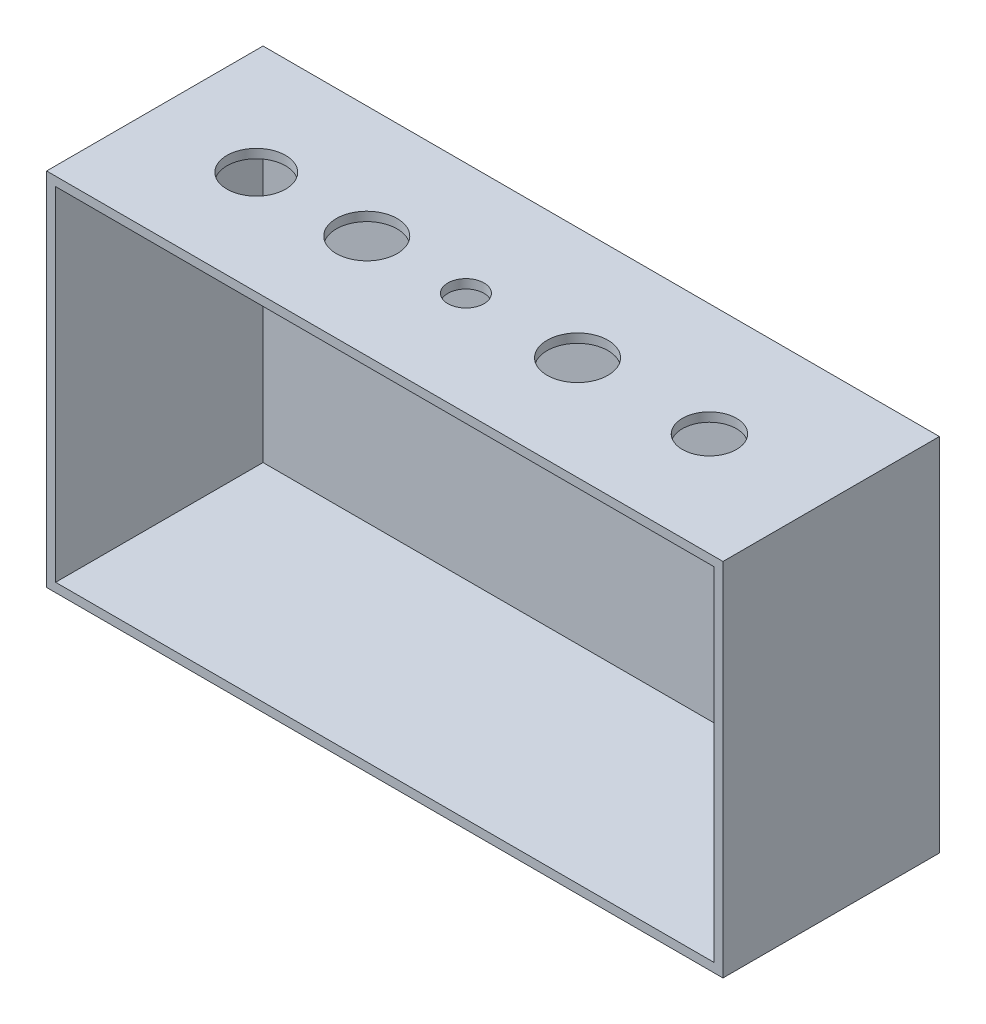
ISO-10303-21;
HEADER;
FILE_DESCRIPTION(('STEP AP214'),'2;1');
FILE_NAME('part.step','',(''),(''),'','','');
FILE_SCHEMA(('AUTOMOTIVE_DESIGN { 1 0 10303 214 1 1 1 1 }'));
ENDSEC;
DATA;
#1=APPLICATION_CONTEXT('core data for automotive mechanical design processes');
#2=APPLICATION_PROTOCOL_DEFINITION('international standard','automotive_design',2000,#1);
#3=PRODUCT_CONTEXT('',#1,'mechanical');
#4=PRODUCT('Part','Part','',(#3));
#5=PRODUCT_RELATED_PRODUCT_CATEGORY('part','',(#4));
#6=PRODUCT_DEFINITION_FORMATION('','',#4);
#7=PRODUCT_DEFINITION_CONTEXT('part definition',#1,'design');
#8=PRODUCT_DEFINITION('design','',#6,#7);
#9=PRODUCT_DEFINITION_SHAPE('','',#8);
#10=(LENGTH_UNIT() NAMED_UNIT(*) SI_UNIT(.MILLI.,.METRE.));
#11=(NAMED_UNIT(*) PLANE_ANGLE_UNIT() SI_UNIT($,.RADIAN.));
#12=(NAMED_UNIT(*) SI_UNIT($,.STERADIAN.) SOLID_ANGLE_UNIT());
#13=UNCERTAINTY_MEASURE_WITH_UNIT(LENGTH_MEASURE(1.E-05),#10,'distance_accuracy_value','');
#14=(GEOMETRIC_REPRESENTATION_CONTEXT(3) GLOBAL_UNCERTAINTY_ASSIGNED_CONTEXT((#13)) GLOBAL_UNIT_ASSIGNED_CONTEXT((#10,
#11,#12)) REPRESENTATION_CONTEXT('',''));
#15=CARTESIAN_POINT('',(0.,0.,0.));
#16=DIRECTION('',(0.,0.,1.));
#17=DIRECTION('',(1.,0.,0.));
#18=AXIS2_PLACEMENT_3D('',#15,#16,#17);
#19=CARTESIAN_POINT('',(2.,-80.,-50.));
#20=DIRECTION('',(-1.,0.,0.));
#21=DIRECTION('',(0.,0.,1.));
#22=AXIS2_PLACEMENT_3D('',#19,#20,#21);
#23=PLANE('',#22);
#24=DIRECTION('',(0.,0.,1.));
#25=VECTOR('',#24,1.);
#26=CARTESIAN_POINT('',(2.,-2.,0.));
#27=LINE('',#26,#25);
#28=CARTESIAN_POINT('',(2.,-2.,-48.));
#29=VERTEX_POINT('',#28);
#30=CARTESIAN_POINT('',(2.,-2.,-2.));
#31=VERTEX_POINT('',#30);
#32=EDGE_CURVE('E143',#29,#31,#27,.T.);
#33=ORIENTED_EDGE('',*,*,#32,.T.);
#34=DIRECTION('',(0.,1.,0.));
#35=VECTOR('',#34,1.);
#36=CARTESIAN_POINT('',(2.,-80.,-2.));
#37=LINE('',#36,#35);
#38=CARTESIAN_POINT('',(2.,-78.,-2.));
#39=VERTEX_POINT('',#38);
#40=EDGE_CURVE('E158',#39,#31,#37,.T.);
#41=ORIENTED_EDGE('',*,*,#40,.F.);
#42=DIRECTION('',(0.,0.,1.));
#43=VECTOR('',#42,1.);
#44=CARTESIAN_POINT('',(2.,-78.,0.));
#45=LINE('',#44,#43);
#46=CARTESIAN_POINT('',(2.,-78.,-48.));
#47=VERTEX_POINT('',#46);
#48=EDGE_CURVE('E135',#47,#39,#45,.T.);
#49=ORIENTED_EDGE('',*,*,#48,.F.);
#50=DIRECTION('',(0.,1.,0.));
#51=VECTOR('',#50,1.);
#52=CARTESIAN_POINT('',(2.,-80.,-48.));
#53=LINE('',#52,#51);
#54=EDGE_CURVE('E69',#47,#29,#53,.T.);
#55=ORIENTED_EDGE('',*,*,#54,.T.);
#56=EDGE_LOOP('',(#33,#41,#49,#55));
#57=FACE_BOUND('',#56,.T.);
#58=ADVANCED_FACE('F31',(#57),#23,.F.);
#59=CARTESIAN_POINT('',(0.,-80.,-48.));
#60=DIRECTION('',(0.,0.,-1.));
#61=DIRECTION('',(-1.,0.,0.));
#62=AXIS2_PLACEMENT_3D('',#59,#60,#61);
#63=PLANE('',#62);
#64=DIRECTION('',(-1.,0.,0.));
#65=VECTOR('',#64,1.);
#66=CARTESIAN_POINT('',(0.,-2.,-48.));
#67=LINE('',#66,#65);
#68=CARTESIAN_POINT('',(148.,-2.,-48.));
#69=VERTEX_POINT('',#68);
#70=EDGE_CURVE('E39',#69,#29,#67,.T.);
#71=ORIENTED_EDGE('',*,*,#70,.T.);
#72=ORIENTED_EDGE('',*,*,#54,.F.);
#73=DIRECTION('',(-1.,0.,0.));
#74=VECTOR('',#73,1.);
#75=CARTESIAN_POINT('',(0.,-78.,-48.));
#76=LINE('',#75,#74);
#77=CARTESIAN_POINT('',(148.,-78.,-48.));
#78=VERTEX_POINT('',#77);
#79=EDGE_CURVE('E155',#78,#47,#76,.T.);
#80=ORIENTED_EDGE('',*,*,#79,.F.);
#81=DIRECTION('',(0.,1.,0.));
#82=VECTOR('',#81,1.);
#83=CARTESIAN_POINT('',(148.,-80.,-48.));
#84=LINE('',#83,#82);
#85=EDGE_CURVE('E54',#78,#69,#84,.T.);
#86=ORIENTED_EDGE('',*,*,#85,.T.);
#87=EDGE_LOOP('',(#71,#72,#80,#86));
#88=FACE_BOUND('',#87,.T.);
#89=ADVANCED_FACE('F171',(#88),#63,.F.);
#90=CARTESIAN_POINT('',(148.,-80.,-50.));
#91=DIRECTION('',(1.,0.,0.));
#92=DIRECTION('',(0.,0.,-1.));
#93=AXIS2_PLACEMENT_3D('',#90,#91,#92);
#94=PLANE('',#93);
#95=DIRECTION('',(0.,0.,-1.));
#96=VECTOR('',#95,1.);
#97=CARTESIAN_POINT('',(148.,-2.,0.));
#98=LINE('',#97,#96);
#99=CARTESIAN_POINT('',(148.,-2.,-2.00000000000001));
#100=VERTEX_POINT('',#99);
#101=EDGE_CURVE('E139',#100,#69,#98,.T.);
#102=ORIENTED_EDGE('',*,*,#101,.T.);
#103=ORIENTED_EDGE('',*,*,#85,.F.);
#104=DIRECTION('',(0.,0.,-1.));
#105=VECTOR('',#104,1.);
#106=CARTESIAN_POINT('',(148.,-78.,0.));
#107=LINE('',#106,#105);
#108=CARTESIAN_POINT('',(148.,-78.,-2.00000000000001));
#109=VERTEX_POINT('',#108);
#110=EDGE_CURVE('E151',#109,#78,#107,.T.);
#111=ORIENTED_EDGE('',*,*,#110,.F.);
#112=DIRECTION('',(0.,1.,0.));
#113=VECTOR('',#112,1.);
#114=CARTESIAN_POINT('',(148.,-80.,-2.));
#115=LINE('',#114,#113);
#116=EDGE_CURVE('E146',#109,#100,#115,.T.);
#117=ORIENTED_EDGE('',*,*,#116,.T.);
#118=EDGE_LOOP('',(#102,#103,#111,#117));
#119=FACE_BOUND('',#118,.T.);
#120=ADVANCED_FACE('F169',(#119),#94,.F.);
#121=CARTESIAN_POINT('',(0.,-78.,0.));
#122=DIRECTION('',(0.,1.,0.));
#123=DIRECTION('',(0.,0.,1.));
#124=AXIS2_PLACEMENT_3D('',#121,#122,#123);
#125=PLANE('',#124);
#126=ORIENTED_EDGE('',*,*,#48,.T.);
#127=DIRECTION('',(1.,0.,0.));
#128=VECTOR('',#127,1.);
#129=CARTESIAN_POINT('',(0.,-78.,-2.));
#130=LINE('',#129,#128);
#131=EDGE_CURVE('E96',#39,#109,#130,.T.);
#132=ORIENTED_EDGE('',*,*,#131,.T.);
#133=ORIENTED_EDGE('',*,*,#110,.T.);
#134=ORIENTED_EDGE('',*,*,#79,.T.);
#135=EDGE_LOOP('',(#126,#132,#133,#134));
#136=FACE_BOUND('',#135,.T.);
#137=ADVANCED_FACE('F161',(#136),#125,.T.);
#138=CARTESIAN_POINT('',(0.,-2.,0.));
#139=DIRECTION('',(0.,1.,0.));
#140=DIRECTION('',(0.,0.,1.));
#141=AXIS2_PLACEMENT_3D('',#138,#139,#140);
#142=PLANE('',#141);
#143=CARTESIAN_POINT('',(124.,-2.,-25.));
#144=DIRECTION('',(0.,1.,0.));
#145=DIRECTION('',(0.,0.,1.));
#146=AXIS2_PLACEMENT_3D('',#143,#144,#145);
#147=CIRCLE('',#146,6.00000000000002);
#148=CARTESIAN_POINT('',(124.,-2.,-19.));
#149=VERTEX_POINT('',#148);
#150=EDGE_CURVE('E198',#149,#149,#147,.F.);
#151=ORIENTED_EDGE('',*,*,#150,.F.);
#152=EDGE_LOOP('',(#151));
#153=FACE_BOUND('',#152,.T.);
#154=CARTESIAN_POINT('',(94.75,-2.,-25.));
#155=DIRECTION('',(0.,1.,0.));
#156=DIRECTION('',(0.,0.,1.));
#157=AXIS2_PLACEMENT_3D('',#154,#155,#156);
#158=CIRCLE('',#157,6.75);
#159=CARTESIAN_POINT('',(94.75,-2.,-18.25));
#160=VERTEX_POINT('',#159);
#161=EDGE_CURVE('E202',#160,#160,#158,.F.);
#162=ORIENTED_EDGE('',*,*,#161,.F.);
#163=EDGE_LOOP('',(#162));
#164=FACE_BOUND('',#163,.T.);
#165=CARTESIAN_POINT('',(70.,-2.,-25.));
#166=DIRECTION('',(0.,1.,0.));
#167=DIRECTION('',(0.,0.,1.));
#168=AXIS2_PLACEMENT_3D('',#165,#166,#167);
#169=CIRCLE('',#168,4.00000000000001);
#170=CARTESIAN_POINT('',(70.,-2.,-21.));
#171=VERTEX_POINT('',#170);
#172=EDGE_CURVE('E206',#171,#171,#169,.F.);
#173=ORIENTED_EDGE('',*,*,#172,.F.);
#174=EDGE_LOOP('',(#173));
#175=FACE_BOUND('',#174,.T.);
#176=CARTESIAN_POINT('',(48.,-2.,-25.));
#177=DIRECTION('',(0.,1.,0.));
#178=DIRECTION('',(0.,0.,1.));
#179=AXIS2_PLACEMENT_3D('',#176,#177,#178);
#180=CIRCLE('',#179,6.75);
#181=CARTESIAN_POINT('',(48.,-2.,-18.25));
#182=VERTEX_POINT('',#181);
#183=EDGE_CURVE('E210',#182,#182,#180,.F.);
#184=ORIENTED_EDGE('',*,*,#183,.F.);
#185=EDGE_LOOP('',(#184));
#186=FACE_BOUND('',#185,.T.);
#187=CARTESIAN_POINT('',(23.5,-2.,-25.));
#188=DIRECTION('',(0.,1.,0.));
#189=DIRECTION('',(0.,0.,1.));
#190=AXIS2_PLACEMENT_3D('',#187,#188,#189);
#191=CIRCLE('',#190,6.50000000000001);
#192=CARTESIAN_POINT('',(23.5,-2.,-18.5));
#193=VERTEX_POINT('',#192);
#194=EDGE_CURVE('E123',#193,#193,#191,.F.);
#195=ORIENTED_EDGE('',*,*,#194,.F.);
#196=EDGE_LOOP('',(#195));
#197=FACE_BOUND('',#196,.T.);
#198=ORIENTED_EDGE('',*,*,#32,.F.);
#199=ORIENTED_EDGE('',*,*,#70,.F.);
#200=ORIENTED_EDGE('',*,*,#101,.F.);
#201=DIRECTION('',(1.,0.,0.));
#202=VECTOR('',#201,1.);
#203=CARTESIAN_POINT('',(0.,-2.,-2.));
#204=LINE('',#203,#202);
#205=EDGE_CURVE('E141',#31,#100,#204,.T.);
#206=ORIENTED_EDGE('',*,*,#205,.F.);
#207=EDGE_LOOP('',(#198,#199,#200,#206));
#208=FACE_BOUND('',#207,.T.);
#209=ADVANCED_FACE('F33',(#153,#164,#175,#186,#197,#208),#142,.F.);
#210=CARTESIAN_POINT('',(23.5,-80.001,-25.));
#211=DIRECTION('',(0.,1.,0.));
#212=DIRECTION('',(0.,0.,1.));
#213=AXIS2_PLACEMENT_3D('',#210,#211,#212);
#214=CYLINDRICAL_SURFACE('',#213,6.50000000000001);
#215=CARTESIAN_POINT('',(23.5,0.,-25.));
#216=DIRECTION('',(0.,1.,0.));
#217=DIRECTION('',(0.,0.,1.));
#218=AXIS2_PLACEMENT_3D('',#215,#216,#217);
#219=CIRCLE('',#218,6.50000000000001);
#220=CARTESIAN_POINT('',(23.5,0.,-18.5));
#221=VERTEX_POINT('',#220);
#222=EDGE_CURVE('E127',#221,#221,#219,.T.);
#223=ORIENTED_EDGE('',*,*,#222,.T.);
#224=EDGE_LOOP('',(#223));
#225=FACE_BOUND('',#224,.T.);
#226=ORIENTED_EDGE('',*,*,#194,.T.);
#227=EDGE_LOOP('',(#226));
#228=FACE_BOUND('',#227,.T.);
#229=ADVANCED_FACE('F187',(#225,#228),#214,.F.);
#230=CARTESIAN_POINT('',(0.,-80.,-50.));
#231=DIRECTION('',(-1.,0.,0.));
#232=DIRECTION('',(0.,0.,1.));
#233=AXIS2_PLACEMENT_3D('',#230,#231,#232);
#234=PLANE('',#233);
#235=DIRECTION('',(0.,-1.,0.));
#236=VECTOR('',#235,1.);
#237=CARTESIAN_POINT('',(0.,0.,-2.00000000000001));
#238=LINE('',#237,#236);
#239=CARTESIAN_POINT('',(0.,0.,-2.00000000000001));
#240=VERTEX_POINT('',#239);
#241=CARTESIAN_POINT('',(0.,-80.,-2.));
#242=VERTEX_POINT('',#241);
#243=EDGE_CURVE('E111',#240,#242,#238,.T.);
#244=ORIENTED_EDGE('',*,*,#243,.F.);
#245=DIRECTION('',(0.,0.,1.));
#246=VECTOR('',#245,1.);
#247=CARTESIAN_POINT('',(0.,0.,-50.));
#248=LINE('',#247,#246);
#249=CARTESIAN_POINT('',(0.,0.,-50.));
#250=VERTEX_POINT('',#249);
#251=EDGE_CURVE('E115',#250,#240,#248,.T.);
#252=ORIENTED_EDGE('',*,*,#251,.F.);
#253=DIRECTION('',(0.,1.,0.));
#254=VECTOR('',#253,1.);
#255=CARTESIAN_POINT('',(0.,-80.,-50.));
#256=LINE('',#255,#254);
#257=CARTESIAN_POINT('',(0.,-80.,-50.));
#258=VERTEX_POINT('',#257);
#259=EDGE_CURVE('E78',#258,#250,#256,.T.);
#260=ORIENTED_EDGE('',*,*,#259,.F.);
#261=DIRECTION('',(0.,0.,1.));
#262=VECTOR('',#261,1.);
#263=CARTESIAN_POINT('',(0.,-80.,-50.));
#264=LINE('',#263,#262);
#265=EDGE_CURVE('E116',#258,#242,#264,.T.);
#266=ORIENTED_EDGE('',*,*,#265,.T.);
#267=EDGE_LOOP('',(#244,#252,#260,#266));
#268=FACE_BOUND('',#267,.T.);
#269=ADVANCED_FACE('F114',(#268),#234,.T.);
#270=CARTESIAN_POINT('',(0.,-80.,-50.));
#271=DIRECTION('',(0.,0.,-1.));
#272=DIRECTION('',(-1.,0.,0.));
#273=AXIS2_PLACEMENT_3D('',#270,#271,#272);
#274=PLANE('',#273);
#275=DIRECTION('',(-1.,0.,0.));
#276=VECTOR('',#275,1.);
#277=CARTESIAN_POINT('',(0.,0.,-50.));
#278=LINE('',#277,#276);
#279=CARTESIAN_POINT('',(150.,0.,-50.));
#280=VERTEX_POINT('',#279);
#281=EDGE_CURVE('E122',#280,#250,#278,.T.);
#282=ORIENTED_EDGE('',*,*,#281,.F.);
#283=DIRECTION('',(0.,1.,0.));
#284=VECTOR('',#283,1.);
#285=CARTESIAN_POINT('',(150.,-80.,-50.));
#286=LINE('',#285,#284);
#287=CARTESIAN_POINT('',(150.,-80.,-50.));
#288=VERTEX_POINT('',#287);
#289=EDGE_CURVE('E136',#288,#280,#286,.T.);
#290=ORIENTED_EDGE('',*,*,#289,.F.);
#291=DIRECTION('',(-1.,0.,0.));
#292=VECTOR('',#291,1.);
#293=CARTESIAN_POINT('',(0.,-80.,-50.));
#294=LINE('',#293,#292);
#295=EDGE_CURVE('E130',#288,#258,#294,.T.);
#296=ORIENTED_EDGE('',*,*,#295,.T.);
#297=ORIENTED_EDGE('',*,*,#259,.T.);
#298=EDGE_LOOP('',(#282,#290,#296,#297));
#299=FACE_BOUND('',#298,.T.);
#300=ADVANCED_FACE('F229',(#299),#274,.T.);
#301=CARTESIAN_POINT('',(150.,-80.,-50.));
#302=DIRECTION('',(1.,0.,0.));
#303=DIRECTION('',(0.,0.,-1.));
#304=AXIS2_PLACEMENT_3D('',#301,#302,#303);
#305=PLANE('',#304);
#306=DIRECTION('',(0.,1.,0.));
#307=VECTOR('',#306,1.);
#308=CARTESIAN_POINT('',(150.,-80.,-2.00000000000001));
#309=LINE('',#308,#307);
#310=CARTESIAN_POINT('',(150.,-80.,-2.));
#311=VERTEX_POINT('',#310);
#312=CARTESIAN_POINT('',(150.,0.,-2.00000000000002));
#313=VERTEX_POINT('',#312);
#314=EDGE_CURVE('E45',#311,#313,#309,.T.);
#315=ORIENTED_EDGE('',*,*,#314,.F.);
#316=DIRECTION('',(0.,0.,-1.));
#317=VECTOR('',#316,1.);
#318=CARTESIAN_POINT('',(150.,-80.,-50.));
#319=LINE('',#318,#317);
#320=EDGE_CURVE('E222',#311,#288,#319,.T.);
#321=ORIENTED_EDGE('',*,*,#320,.T.);
#322=ORIENTED_EDGE('',*,*,#289,.T.);
#323=DIRECTION('',(0.,0.,-1.));
#324=VECTOR('',#323,1.);
#325=CARTESIAN_POINT('',(150.,0.,-50.));
#326=LINE('',#325,#324);
#327=EDGE_CURVE('E89',#313,#280,#326,.T.);
#328=ORIENTED_EDGE('',*,*,#327,.F.);
#329=EDGE_LOOP('',(#315,#321,#322,#328));
#330=FACE_BOUND('',#329,.T.);
#331=ADVANCED_FACE('F265',(#330),#305,.T.);
#332=CARTESIAN_POINT('',(0.,-80.,0.));
#333=DIRECTION('',(0.,1.,0.));
#334=DIRECTION('',(0.,0.,1.));
#335=AXIS2_PLACEMENT_3D('',#332,#333,#334);
#336=PLANE('',#335);
#337=ORIENTED_EDGE('',*,*,#320,.F.);
#338=DIRECTION('',(-1.,0.,0.));
#339=VECTOR('',#338,1.);
#340=CARTESIAN_POINT('',(200.,-80.,-2.));
#341=LINE('',#340,#339);
#342=EDGE_CURVE('E117',#311,#242,#341,.T.);
#343=ORIENTED_EDGE('',*,*,#342,.T.);
#344=ORIENTED_EDGE('',*,*,#265,.F.);
#345=ORIENTED_EDGE('',*,*,#295,.F.);
#346=EDGE_LOOP('',(#337,#343,#344,#345));
#347=FACE_BOUND('',#346,.T.);
#348=ADVANCED_FACE('F231',(#347),#336,.F.);
#349=CARTESIAN_POINT('',(0.,0.,0.));
#350=DIRECTION('',(0.,1.,0.));
#351=DIRECTION('',(0.,0.,1.));
#352=AXIS2_PLACEMENT_3D('',#349,#350,#351);
#353=PLANE('',#352);
#354=DIRECTION('',(-1.,0.,0.));
#355=VECTOR('',#354,1.);
#356=CARTESIAN_POINT('',(0.,0.,-2.00000000000001));
#357=LINE('',#356,#355);
#358=EDGE_CURVE('E11',#313,#240,#357,.T.);
#359=ORIENTED_EDGE('',*,*,#358,.F.);
#360=ORIENTED_EDGE('',*,*,#327,.T.);
#361=ORIENTED_EDGE('',*,*,#281,.T.);
#362=ORIENTED_EDGE('',*,*,#251,.T.);
#363=EDGE_LOOP('',(#359,#360,#361,#362));
#364=FACE_BOUND('',#363,.T.);
#365=CARTESIAN_POINT('',(124.,0.,-25.));
#366=DIRECTION('',(0.,1.,0.));
#367=DIRECTION('',(0.,0.,1.));
#368=AXIS2_PLACEMENT_3D('',#365,#366,#367);
#369=CIRCLE('',#368,6.00000000000002);
#370=CARTESIAN_POINT('',(124.,0.,-19.));
#371=VERTEX_POINT('',#370);
#372=EDGE_CURVE('E233',#371,#371,#369,.T.);
#373=ORIENTED_EDGE('',*,*,#372,.F.);
#374=EDGE_LOOP('',(#373));
#375=FACE_BOUND('',#374,.T.);
#376=CARTESIAN_POINT('',(94.75,0.,-25.));
#377=DIRECTION('',(0.,1.,0.));
#378=DIRECTION('',(0.,0.,1.));
#379=AXIS2_PLACEMENT_3D('',#376,#377,#378);
#380=CIRCLE('',#379,6.75);
#381=CARTESIAN_POINT('',(94.75,0.,-18.25));
#382=VERTEX_POINT('',#381);
#383=EDGE_CURVE('E239',#382,#382,#380,.T.);
#384=ORIENTED_EDGE('',*,*,#383,.F.);
#385=EDGE_LOOP('',(#384));
#386=FACE_BOUND('',#385,.T.);
#387=CARTESIAN_POINT('',(70.,0.,-25.));
#388=DIRECTION('',(0.,1.,0.));
#389=DIRECTION('',(0.,0.,1.));
#390=AXIS2_PLACEMENT_3D('',#387,#388,#389);
#391=CIRCLE('',#390,4.00000000000001);
#392=CARTESIAN_POINT('',(70.,0.,-21.));
#393=VERTEX_POINT('',#392);
#394=EDGE_CURVE('E243',#393,#393,#391,.T.);
#395=ORIENTED_EDGE('',*,*,#394,.F.);
#396=EDGE_LOOP('',(#395));
#397=FACE_BOUND('',#396,.T.);
#398=CARTESIAN_POINT('',(48.,0.,-25.));
#399=DIRECTION('',(0.,1.,0.));
#400=DIRECTION('',(0.,0.,1.));
#401=AXIS2_PLACEMENT_3D('',#398,#399,#400);
#402=CIRCLE('',#401,6.75);
#403=CARTESIAN_POINT('',(48.,0.,-18.25));
#404=VERTEX_POINT('',#403);
#405=EDGE_CURVE('E214',#404,#404,#402,.T.);
#406=ORIENTED_EDGE('',*,*,#405,.F.);
#407=EDGE_LOOP('',(#406));
#408=FACE_BOUND('',#407,.T.);
#409=ORIENTED_EDGE('',*,*,#222,.F.);
#410=EDGE_LOOP('',(#409));
#411=FACE_BOUND('',#410,.T.);
#412=ADVANCED_FACE('F119',(#364,#375,#386,#397,#408,#411),#353,.T.);
#413=CARTESIAN_POINT('',(48.,-80.001,-25.));
#414=DIRECTION('',(0.,1.,0.));
#415=DIRECTION('',(0.,0.,1.));
#416=AXIS2_PLACEMENT_3D('',#413,#414,#415);
#417=CYLINDRICAL_SURFACE('',#416,6.75);
#418=ORIENTED_EDGE('',*,*,#405,.T.);
#419=EDGE_LOOP('',(#418));
#420=FACE_BOUND('',#419,.T.);
#421=ORIENTED_EDGE('',*,*,#183,.T.);
#422=EDGE_LOOP('',(#421));
#423=FACE_BOUND('',#422,.T.);
#424=ADVANCED_FACE('F249',(#420,#423),#417,.F.);
#425=CARTESIAN_POINT('',(70.,-80.001,-25.));
#426=DIRECTION('',(0.,1.,0.));
#427=DIRECTION('',(0.,0.,1.));
#428=AXIS2_PLACEMENT_3D('',#425,#426,#427);
#429=CYLINDRICAL_SURFACE('',#428,4.00000000000001);
#430=ORIENTED_EDGE('',*,*,#394,.T.);
#431=EDGE_LOOP('',(#430));
#432=FACE_BOUND('',#431,.T.);
#433=ORIENTED_EDGE('',*,*,#172,.T.);
#434=EDGE_LOOP('',(#433));
#435=FACE_BOUND('',#434,.T.);
#436=ADVANCED_FACE('F246',(#432,#435),#429,.F.);
#437=CARTESIAN_POINT('',(94.75,-80.001,-25.));
#438=DIRECTION('',(0.,1.,0.));
#439=DIRECTION('',(0.,0.,1.));
#440=AXIS2_PLACEMENT_3D('',#437,#438,#439);
#441=CYLINDRICAL_SURFACE('',#440,6.75);
#442=ORIENTED_EDGE('',*,*,#383,.T.);
#443=EDGE_LOOP('',(#442));
#444=FACE_BOUND('',#443,.T.);
#445=ORIENTED_EDGE('',*,*,#161,.T.);
#446=EDGE_LOOP('',(#445));
#447=FACE_BOUND('',#446,.T.);
#448=ADVANCED_FACE('F248',(#444,#447),#441,.F.);
#449=CARTESIAN_POINT('',(124.,-80.001,-25.));
#450=DIRECTION('',(0.,1.,0.));
#451=DIRECTION('',(0.,0.,1.));
#452=AXIS2_PLACEMENT_3D('',#449,#450,#451);
#453=CYLINDRICAL_SURFACE('',#452,6.00000000000002);
#454=ORIENTED_EDGE('',*,*,#372,.T.);
#455=EDGE_LOOP('',(#454));
#456=FACE_BOUND('',#455,.T.);
#457=ORIENTED_EDGE('',*,*,#150,.T.);
#458=EDGE_LOOP('',(#457));
#459=FACE_BOUND('',#458,.T.);
#460=ADVANCED_FACE('F256',(#456,#459),#453,.F.);
#461=CARTESIAN_POINT('',(200.,0.,-2.00000000000001));
#462=DIRECTION('',(0.,0.,-1.));
#463=DIRECTION('',(0.,1.,0.));
#464=AXIS2_PLACEMENT_3D('',#461,#462,#463);
#465=PLANE('',#464);
#466=ORIENTED_EDGE('',*,*,#131,.F.);
#467=ORIENTED_EDGE('',*,*,#40,.T.);
#468=ORIENTED_EDGE('',*,*,#205,.T.);
#469=ORIENTED_EDGE('',*,*,#116,.F.);
#470=EDGE_LOOP('',(#466,#467,#468,#469));
#471=FACE_BOUND('',#470,.T.);
#472=ORIENTED_EDGE('',*,*,#314,.T.);
#473=ORIENTED_EDGE('',*,*,#358,.T.);
#474=ORIENTED_EDGE('',*,*,#243,.T.);
#475=ORIENTED_EDGE('',*,*,#342,.F.);
#476=EDGE_LOOP('',(#472,#473,#474,#475));
#477=FACE_BOUND('',#476,.T.);
#478=ADVANCED_FACE('F110',(#471,#477),#465,.F.);
#479=CLOSED_SHELL('',(#58,#89,#120,#137,#209,#229,#269,#300,#331,#348,#412,#424,#436,#448,#460,#478));
#480=MANIFOLD_SOLID_BREP('B2',#479);
#481=ADVANCED_BREP_SHAPE_REPRESENTATION('',(#18,#480),#14);
#482=SHAPE_DEFINITION_REPRESENTATION(#9,#481);
ENDSEC;
END-ISO-10303-21;
